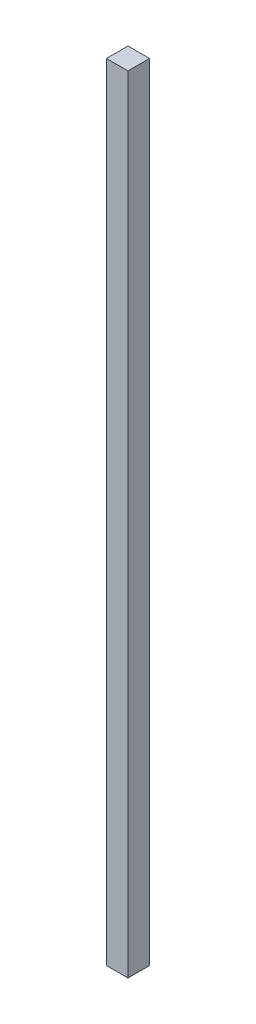
ISO-10303-21;
HEADER;
FILE_DESCRIPTION(('STEP AP214'),'2;1');
FILE_NAME('part.step','',(''),(''),'','','');
FILE_SCHEMA(('AUTOMOTIVE_DESIGN { 1 0 10303 214 1 1 1 1 }'));
ENDSEC;
DATA;
#1=APPLICATION_CONTEXT('core data for automotive mechanical design processes');
#2=APPLICATION_PROTOCOL_DEFINITION('international standard','automotive_design',2000,#1);
#3=PRODUCT_CONTEXT('',#1,'mechanical');
#4=PRODUCT('Part','Part','',(#3));
#5=PRODUCT_RELATED_PRODUCT_CATEGORY('part','',(#4));
#6=PRODUCT_DEFINITION_FORMATION('','',#4);
#7=PRODUCT_DEFINITION_CONTEXT('part definition',#1,'design');
#8=PRODUCT_DEFINITION('design','',#6,#7);
#9=PRODUCT_DEFINITION_SHAPE('','',#8);
#10=(LENGTH_UNIT() NAMED_UNIT(*) SI_UNIT(.MILLI.,.METRE.));
#11=(NAMED_UNIT(*) PLANE_ANGLE_UNIT() SI_UNIT($,.RADIAN.));
#12=(NAMED_UNIT(*) SI_UNIT($,.STERADIAN.) SOLID_ANGLE_UNIT());
#13=UNCERTAINTY_MEASURE_WITH_UNIT(LENGTH_MEASURE(1.E-05),#10,'distance_accuracy_value','');
#14=(GEOMETRIC_REPRESENTATION_CONTEXT(3) GLOBAL_UNCERTAINTY_ASSIGNED_CONTEXT((#13)) GLOBAL_UNIT_ASSIGNED_CONTEXT((#10,
#11,#12)) REPRESENTATION_CONTEXT('',''));
#15=CARTESIAN_POINT('',(0.,0.,0.));
#16=DIRECTION('',(0.,0.,1.));
#17=DIRECTION('',(1.,0.,0.));
#18=AXIS2_PLACEMENT_3D('',#15,#16,#17);
#19=CARTESIAN_POINT('',(38.1,2775.06872708,-38.1));
#20=DIRECTION('',(-1.,0.,0.));
#21=DIRECTION('',(0.,0.,1.));
#22=AXIS2_PLACEMENT_3D('',#19,#20,#21);
#23=PLANE('',#22);
#24=DIRECTION('',(0.,0.,-1.));
#25=VECTOR('',#24,1.);
#26=CARTESIAN_POINT('',(38.1,0.,-38.1));
#27=LINE('',#26,#25);
#28=CARTESIAN_POINT('',(38.1,0.,38.1));
#29=VERTEX_POINT('',#28);
#30=CARTESIAN_POINT('',(38.1,0.,-38.1));
#31=VERTEX_POINT('',#30);
#32=EDGE_CURVE('E107',#29,#31,#27,.T.);
#33=ORIENTED_EDGE('',*,*,#32,.T.);
#34=DIRECTION('',(0.,-1.,0.));
#35=VECTOR('',#34,1.);
#36=CARTESIAN_POINT('',(38.1,2775.06872708,-38.1));
#37=LINE('',#36,#35);
#38=CARTESIAN_POINT('',(38.1,2775.06872708,-38.1));
#39=VERTEX_POINT('',#38);
#40=EDGE_CURVE('E11',#39,#31,#37,.T.);
#41=ORIENTED_EDGE('',*,*,#40,.F.);
#42=DIRECTION('',(0.,0.,-1.));
#43=VECTOR('',#42,1.);
#44=CARTESIAN_POINT('',(38.1,2775.06872708,-38.1));
#45=LINE('',#44,#43);
#46=CARTESIAN_POINT('',(38.1,2775.06872708,38.1));
#47=VERTEX_POINT('',#46);
#48=EDGE_CURVE('E91',#47,#39,#45,.T.);
#49=ORIENTED_EDGE('',*,*,#48,.F.);
#50=DIRECTION('',(0.,-1.,0.));
#51=VECTOR('',#50,1.);
#52=CARTESIAN_POINT('',(38.1,2775.06872708,38.1));
#53=LINE('',#52,#51);
#54=EDGE_CURVE('E103',#47,#29,#53,.T.);
#55=ORIENTED_EDGE('',*,*,#54,.T.);
#56=EDGE_LOOP('',(#33,#41,#49,#55));
#57=FACE_BOUND('',#56,.T.);
#58=ADVANCED_FACE('F39',(#57),#23,.F.);
#59=CARTESIAN_POINT('',(-38.1,2775.06872708,-38.1));
#60=DIRECTION('',(0.,0.,1.));
#61=DIRECTION('',(1.,0.,0.));
#62=AXIS2_PLACEMENT_3D('',#59,#60,#61);
#63=PLANE('',#62);
#64=DIRECTION('',(-1.,0.,0.));
#65=VECTOR('',#64,1.);
#66=CARTESIAN_POINT('',(-38.1,0.,-38.1));
#67=LINE('',#66,#65);
#68=CARTESIAN_POINT('',(-38.1,0.,-38.1));
#69=VERTEX_POINT('',#68);
#70=EDGE_CURVE('E96',#31,#69,#67,.T.);
#71=ORIENTED_EDGE('',*,*,#70,.T.);
#72=DIRECTION('',(0.,-1.,0.));
#73=VECTOR('',#72,1.);
#74=CARTESIAN_POINT('',(-38.1,2775.06872708,-38.1));
#75=LINE('',#74,#73);
#76=CARTESIAN_POINT('',(-38.1,2775.06872708,-38.1));
#77=VERTEX_POINT('',#76);
#78=EDGE_CURVE('E48',#77,#69,#75,.T.);
#79=ORIENTED_EDGE('',*,*,#78,.F.);
#80=DIRECTION('',(-1.,0.,0.));
#81=VECTOR('',#80,1.);
#82=CARTESIAN_POINT('',(-38.1,2775.06872708,-38.1));
#83=LINE('',#82,#81);
#84=EDGE_CURVE('E86',#39,#77,#83,.T.);
#85=ORIENTED_EDGE('',*,*,#84,.F.);
#86=ORIENTED_EDGE('',*,*,#40,.T.);
#87=EDGE_LOOP('',(#71,#79,#85,#86));
#88=FACE_BOUND('',#87,.T.);
#89=ADVANCED_FACE('F95',(#88),#63,.F.);
#90=CARTESIAN_POINT('',(-38.1,2775.06872708,-38.1));
#91=DIRECTION('',(1.,0.,0.));
#92=DIRECTION('',(0.,0.,-1.));
#93=AXIS2_PLACEMENT_3D('',#90,#91,#92);
#94=PLANE('',#93);
#95=DIRECTION('',(0.,0.,1.));
#96=VECTOR('',#95,1.);
#97=CARTESIAN_POINT('',(-38.1,0.,-38.1));
#98=LINE('',#97,#96);
#99=CARTESIAN_POINT('',(-38.1,0.,38.1));
#100=VERTEX_POINT('',#99);
#101=EDGE_CURVE('E73',#69,#100,#98,.T.);
#102=ORIENTED_EDGE('',*,*,#101,.T.);
#103=DIRECTION('',(0.,-1.,0.));
#104=VECTOR('',#103,1.);
#105=CARTESIAN_POINT('',(-38.1,2775.06872708,38.1));
#106=LINE('',#105,#104);
#107=CARTESIAN_POINT('',(-38.1,2775.06872708,38.1));
#108=VERTEX_POINT('',#107);
#109=EDGE_CURVE('E98',#108,#100,#106,.T.);
#110=ORIENTED_EDGE('',*,*,#109,.F.);
#111=DIRECTION('',(0.,0.,1.));
#112=VECTOR('',#111,1.);
#113=CARTESIAN_POINT('',(-38.1,2775.06872708,-38.1));
#114=LINE('',#113,#112);
#115=EDGE_CURVE('E89',#77,#108,#114,.T.);
#116=ORIENTED_EDGE('',*,*,#115,.F.);
#117=ORIENTED_EDGE('',*,*,#78,.T.);
#118=EDGE_LOOP('',(#102,#110,#116,#117));
#119=FACE_BOUND('',#118,.T.);
#120=ADVANCED_FACE('F99',(#119),#94,.F.);
#121=CARTESIAN_POINT('',(-38.1,2775.06872708,38.1));
#122=DIRECTION('',(0.,0.,-1.));
#123=DIRECTION('',(-1.,0.,0.));
#124=AXIS2_PLACEMENT_3D('',#121,#122,#123);
#125=PLANE('',#124);
#126=DIRECTION('',(1.,0.,0.));
#127=VECTOR('',#126,1.);
#128=CARTESIAN_POINT('',(-38.1,0.,38.1));
#129=LINE('',#128,#127);
#130=EDGE_CURVE('E79',#100,#29,#129,.T.);
#131=ORIENTED_EDGE('',*,*,#130,.T.);
#132=ORIENTED_EDGE('',*,*,#54,.F.);
#133=DIRECTION('',(1.,0.,0.));
#134=VECTOR('',#133,1.);
#135=CARTESIAN_POINT('',(-38.1,2775.06872708,38.1));
#136=LINE('',#135,#134);
#137=EDGE_CURVE('E56',#108,#47,#136,.T.);
#138=ORIENTED_EDGE('',*,*,#137,.F.);
#139=ORIENTED_EDGE('',*,*,#109,.T.);
#140=EDGE_LOOP('',(#131,#132,#138,#139));
#141=FACE_BOUND('',#140,.T.);
#142=ADVANCED_FACE('F120',(#141),#125,.F.);
#143=CARTESIAN_POINT('',(0.,2775.06872708,0.));
#144=DIRECTION('',(0.,1.,0.));
#145=DIRECTION('',(0.,0.,1.));
#146=AXIS2_PLACEMENT_3D('',#143,#144,#145);
#147=PLANE('',#146);
#148=ORIENTED_EDGE('',*,*,#48,.T.);
#149=ORIENTED_EDGE('',*,*,#84,.T.);
#150=ORIENTED_EDGE('',*,*,#115,.T.);
#151=ORIENTED_EDGE('',*,*,#137,.T.);
#152=EDGE_LOOP('',(#148,#149,#150,#151));
#153=FACE_BOUND('',#152,.T.);
#154=ADVANCED_FACE('F87',(#153),#147,.T.);
#155=CARTESIAN_POINT('',(0.,0.,0.));
#156=DIRECTION('',(0.,1.,0.));
#157=DIRECTION('',(0.,0.,1.));
#158=AXIS2_PLACEMENT_3D('',#155,#156,#157);
#159=PLANE('',#158);
#160=ORIENTED_EDGE('',*,*,#32,.F.);
#161=ORIENTED_EDGE('',*,*,#130,.F.);
#162=ORIENTED_EDGE('',*,*,#101,.F.);
#163=ORIENTED_EDGE('',*,*,#70,.F.);
#164=EDGE_LOOP('',(#160,#161,#162,#163));
#165=FACE_BOUND('',#164,.T.);
#166=ADVANCED_FACE('F123',(#165),#159,.F.);
#167=CLOSED_SHELL('',(#58,#89,#120,#142,#154,#166));
#168=MANIFOLD_SOLID_BREP('B2',#167);
#169=ADVANCED_BREP_SHAPE_REPRESENTATION('',(#18,#168),#14);
#170=SHAPE_DEFINITION_REPRESENTATION(#9,#169);
ENDSEC;
END-ISO-10303-21;
